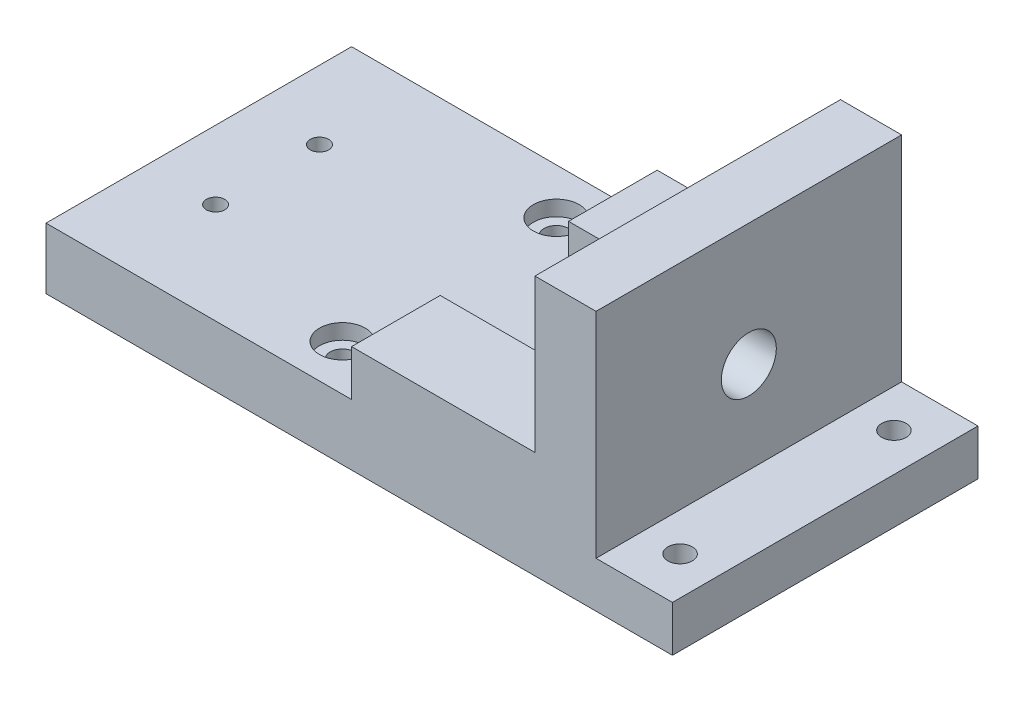
ISO-10303-21;
HEADER;
FILE_DESCRIPTION(('STEP AP214'),'2;1');
FILE_NAME('part.step','',(''),(''),'','','');
FILE_SCHEMA(('AUTOMOTIVE_DESIGN { 1 0 10303 214 1 1 1 1 }'));
ENDSEC;
DATA;
#1=APPLICATION_CONTEXT('core data for automotive mechanical design processes');
#2=APPLICATION_PROTOCOL_DEFINITION('international standard','automotive_design',2000,#1);
#3=PRODUCT_CONTEXT('',#1,'mechanical');
#4=PRODUCT('Part','Part','',(#3));
#5=PRODUCT_RELATED_PRODUCT_CATEGORY('part','',(#4));
#6=PRODUCT_DEFINITION_FORMATION('','',#4);
#7=PRODUCT_DEFINITION_CONTEXT('part definition',#1,'design');
#8=PRODUCT_DEFINITION('design','',#6,#7);
#9=PRODUCT_DEFINITION_SHAPE('','',#8);
#10=(LENGTH_UNIT() NAMED_UNIT(*) SI_UNIT(.MILLI.,.METRE.));
#11=(NAMED_UNIT(*) PLANE_ANGLE_UNIT() SI_UNIT($,.RADIAN.));
#12=(NAMED_UNIT(*) SI_UNIT($,.STERADIAN.) SOLID_ANGLE_UNIT());
#13=UNCERTAINTY_MEASURE_WITH_UNIT(LENGTH_MEASURE(1.E-05),#10,'distance_accuracy_value','');
#14=(GEOMETRIC_REPRESENTATION_CONTEXT(3) GLOBAL_UNCERTAINTY_ASSIGNED_CONTEXT((#13)) GLOBAL_UNIT_ASSIGNED_CONTEXT((#10,
#11,#12)) REPRESENTATION_CONTEXT('',''));
#15=CARTESIAN_POINT('',(0.,0.,0.));
#16=DIRECTION('',(0.,0.,1.));
#17=DIRECTION('',(1.,0.,0.));
#18=AXIS2_PLACEMENT_3D('',#15,#16,#17);
#19=CARTESIAN_POINT('',(-105.,20.,50.));
#20=DIRECTION('',(0.,-1.,0.));
#21=DIRECTION('',(1.,0.,0.));
#22=AXIS2_PLACEMENT_3D('',#19,#20,#21);
#23=PLANE('',#22);
#24=DIRECTION('',(-1.,0.,0.));
#25=VECTOR('',#24,1.);
#26=CARTESIAN_POINT('',(-105.,20.,-50.));
#27=LINE('',#26,#25);
#28=CARTESIAN_POINT('',(-105.,20.,-50.));
#29=VERTEX_POINT('',#28);
#30=CARTESIAN_POINT('',(-205.,20.,-50.));
#31=VERTEX_POINT('',#30);
#32=EDGE_CURVE('E198',#29,#31,#27,.T.);
#33=ORIENTED_EDGE('',*,*,#32,.T.);
#34=DIRECTION('',(0.,0.,-1.));
#35=VECTOR('',#34,1.);
#36=CARTESIAN_POINT('',(-205.,20.,50.));
#37=LINE('',#36,#35);
#38=CARTESIAN_POINT('',(-205.,20.,50.));
#39=VERTEX_POINT('',#38);
#40=EDGE_CURVE('E160',#39,#31,#37,.T.);
#41=ORIENTED_EDGE('',*,*,#40,.F.);
#42=DIRECTION('',(-1.,0.,0.));
#43=VECTOR('',#42,1.);
#44=CARTESIAN_POINT('',(-105.,20.,50.));
#45=LINE('',#44,#43);
#46=CARTESIAN_POINT('',(-105.,20.,50.));
#47=VERTEX_POINT('',#46);
#48=EDGE_CURVE('E139',#47,#39,#45,.T.);
#49=ORIENTED_EDGE('',*,*,#48,.F.);
#50=DIRECTION('',(0.,0.,-1.));
#51=VECTOR('',#50,1.);
#52=CARTESIAN_POINT('',(-105.,20.,50.));
#53=LINE('',#52,#51);
#54=CARTESIAN_POINT('',(-105.,20.,21.));
#55=VERTEX_POINT('',#54);
#56=EDGE_CURVE('E150',#47,#55,#53,.T.);
#57=ORIENTED_EDGE('',*,*,#56,.T.);
#58=DIRECTION('',(1.,0.,0.));
#59=VECTOR('',#58,1.);
#60=CARTESIAN_POINT('',(-105.,20.,21.));
#61=LINE('',#60,#59);
#62=CARTESIAN_POINT('',(-45.,20.,21.));
#63=VERTEX_POINT('',#62);
#64=EDGE_CURVE('E303',#55,#63,#61,.T.);
#65=ORIENTED_EDGE('',*,*,#64,.T.);
#66=DIRECTION('',(0.,0.,-1.));
#67=VECTOR('',#66,1.);
#68=CARTESIAN_POINT('',(-45.,20.,-21.));
#69=LINE('',#68,#67);
#70=CARTESIAN_POINT('',(-45.,20.,-21.));
#71=VERTEX_POINT('',#70);
#72=EDGE_CURVE('E314',#63,#71,#69,.T.);
#73=ORIENTED_EDGE('',*,*,#72,.T.);
#74=DIRECTION('',(-1.,0.,0.));
#75=VECTOR('',#74,1.);
#76=CARTESIAN_POINT('',(-105.,20.,-21.));
#77=LINE('',#76,#75);
#78=CARTESIAN_POINT('',(-105.,20.,-21.));
#79=VERTEX_POINT('',#78);
#80=EDGE_CURVE('E58',#71,#79,#77,.T.);
#81=ORIENTED_EDGE('',*,*,#80,.T.);
#82=EDGE_CURVE('E157',#79,#29,#53,.T.);
#83=ORIENTED_EDGE('',*,*,#82,.T.);
#84=EDGE_LOOP('',(#33,#41,#49,#57,#65,#73,#81,#83));
#85=FACE_BOUND('',#84,.T.);
#86=CARTESIAN_POINT('',(-182.5,20.,17.));
#87=DIRECTION('',(0.,-1.,0.));
#88=DIRECTION('',(1.,0.,0.));
#89=AXIS2_PLACEMENT_3D('',#86,#87,#88);
#90=CIRCLE('',#89,2.99999999999999);
#91=CARTESIAN_POINT('',(-179.5,20.,17.));
#92=VERTEX_POINT('',#91);
#93=EDGE_CURVE('E269',#92,#92,#90,.T.);
#94=ORIENTED_EDGE('',*,*,#93,.T.);
#95=EDGE_LOOP('',(#94));
#96=FACE_BOUND('',#95,.T.);
#97=CARTESIAN_POINT('',(-182.5,20.,-17.));
#98=DIRECTION('',(0.,1.,0.));
#99=DIRECTION('',(-1.,0.,0.));
#100=AXIS2_PLACEMENT_3D('',#97,#98,#99);
#101=CIRCLE('',#100,2.99999999999999);
#102=CARTESIAN_POINT('',(-185.5,20.,-17.));
#103=VERTEX_POINT('',#102);
#104=EDGE_CURVE('E281',#103,#103,#101,.T.);
#105=ORIENTED_EDGE('',*,*,#104,.F.);
#106=EDGE_LOOP('',(#105));
#107=FACE_BOUND('',#106,.T.);
#108=CARTESIAN_POINT('',(-123.,20.,-35.));
#109=DIRECTION('',(0.,1.,0.));
#110=DIRECTION('',(-1.,0.,0.));
#111=AXIS2_PLACEMENT_3D('',#108,#109,#110);
#112=CIRCLE('',#111,7.50000000000001);
#113=CARTESIAN_POINT('',(-130.5,20.,-35.));
#114=VERTEX_POINT('',#113);
#115=EDGE_CURVE('E256',#114,#114,#112,.T.);
#116=ORIENTED_EDGE('',*,*,#115,.F.);
#117=EDGE_LOOP('',(#116));
#118=FACE_BOUND('',#117,.T.);
#119=CARTESIAN_POINT('',(-123.,20.,35.));
#120=DIRECTION('',(0.,-1.,0.));
#121=DIRECTION('',(1.,0.,0.));
#122=AXIS2_PLACEMENT_3D('',#119,#120,#121);
#123=CIRCLE('',#122,7.50000000000001);
#124=CARTESIAN_POINT('',(-115.5,20.,35.));
#125=VERTEX_POINT('',#124);
#126=EDGE_CURVE('E263',#125,#125,#123,.T.);
#127=ORIENTED_EDGE('',*,*,#126,.T.);
#128=EDGE_LOOP('',(#127));
#129=FACE_BOUND('',#128,.T.);
#130=ADVANCED_FACE('F40',(#85,#96,#107,#118,#129),#23,.F.);
#131=CARTESIAN_POINT('',(-123.,0.,-35.));
#132=DIRECTION('',(0.,1.,0.));
#133=DIRECTION('',(-1.,0.,0.));
#134=AXIS2_PLACEMENT_3D('',#131,#132,#133);
#135=CYLINDRICAL_SURFACE('',#134,3.99999999999999);
#136=CARTESIAN_POINT('',(-123.,0.,-35.));
#137=DIRECTION('',(0.,1.,0.));
#138=DIRECTION('',(-1.,0.,0.));
#139=AXIS2_PLACEMENT_3D('',#136,#137,#138);
#140=CIRCLE('',#139,3.99999999999999);
#141=CARTESIAN_POINT('',(-127.,0.,-35.));
#142=VERTEX_POINT('',#141);
#143=EDGE_CURVE('E277',#142,#142,#140,.T.);
#144=ORIENTED_EDGE('',*,*,#143,.F.);
#145=EDGE_LOOP('',(#144));
#146=FACE_BOUND('',#145,.T.);
#147=CARTESIAN_POINT('',(-123.,15.,-35.));
#148=DIRECTION('',(0.,1.,0.));
#149=DIRECTION('',(-1.,0.,0.));
#150=AXIS2_PLACEMENT_3D('',#147,#148,#149);
#151=CIRCLE('',#150,3.99999999999999);
#152=CARTESIAN_POINT('',(-127.,15.,-35.));
#153=VERTEX_POINT('',#152);
#154=EDGE_CURVE('E244',#153,#153,#151,.F.);
#155=ORIENTED_EDGE('',*,*,#154,.F.);
#156=EDGE_LOOP('',(#155));
#157=FACE_BOUND('',#156,.T.);
#158=ADVANCED_FACE('F457',(#146,#157),#135,.F.);
#159=CARTESIAN_POINT('',(-205.,0.,50.));
#160=DIRECTION('',(0.,1.,0.));
#161=DIRECTION('',(0.,0.,1.));
#162=AXIS2_PLACEMENT_3D('',#159,#160,#161);
#163=PLANE('',#162);
#164=ORIENTED_EDGE('',*,*,#143,.T.);
#165=EDGE_LOOP('',(#164));
#166=FACE_BOUND('',#165,.T.);
#167=CARTESIAN_POINT('',(-182.5,0.,-17.));
#168=DIRECTION('',(0.,1.,0.));
#169=DIRECTION('',(-1.,0.,0.));
#170=AXIS2_PLACEMENT_3D('',#167,#168,#169);
#171=CIRCLE('',#170,2.99999999999999);
#172=CARTESIAN_POINT('',(-185.5,0.,-17.));
#173=VERTEX_POINT('',#172);
#174=EDGE_CURVE('E285',#173,#173,#171,.T.);
#175=ORIENTED_EDGE('',*,*,#174,.T.);
#176=EDGE_LOOP('',(#175));
#177=FACE_BOUND('',#176,.T.);
#178=CARTESIAN_POINT('',(-12.5,0.,-35.));
#179=DIRECTION('',(0.,1.,0.));
#180=DIRECTION('',(-1.,0.,0.));
#181=AXIS2_PLACEMENT_3D('',#178,#179,#180);
#182=CIRCLE('',#181,4.00000000000001);
#183=CARTESIAN_POINT('',(-16.5,0.,-35.));
#184=VERTEX_POINT('',#183);
#185=EDGE_CURVE('E240',#184,#184,#182,.T.);
#186=ORIENTED_EDGE('',*,*,#185,.T.);
#187=EDGE_LOOP('',(#186));
#188=FACE_BOUND('',#187,.T.);
#189=DIRECTION('',(1.,0.,0.));
#190=VECTOR('',#189,1.);
#191=CARTESIAN_POINT('',(-205.,0.,-50.));
#192=LINE('',#191,#190);
#193=CARTESIAN_POINT('',(-205.,0.,-50.));
#194=VERTEX_POINT('',#193);
#195=CARTESIAN_POINT('',(0.,0.,-50.));
#196=VERTEX_POINT('',#195);
#197=EDGE_CURVE('E169',#194,#196,#192,.T.);
#198=ORIENTED_EDGE('',*,*,#197,.T.);
#199=DIRECTION('',(0.,0.,-1.));
#200=VECTOR('',#199,1.);
#201=CARTESIAN_POINT('',(0.,0.,50.));
#202=LINE('',#201,#200);
#203=CARTESIAN_POINT('',(0.,0.,50.));
#204=VERTEX_POINT('',#203);
#205=EDGE_CURVE('E11',#204,#196,#202,.T.);
#206=ORIENTED_EDGE('',*,*,#205,.F.);
#207=DIRECTION('',(1.,0.,0.));
#208=VECTOR('',#207,1.);
#209=CARTESIAN_POINT('',(-205.,0.,50.));
#210=LINE('',#209,#208);
#211=CARTESIAN_POINT('',(-205.,0.,50.));
#212=VERTEX_POINT('',#211);
#213=EDGE_CURVE('E203',#212,#204,#210,.T.);
#214=ORIENTED_EDGE('',*,*,#213,.F.);
#215=DIRECTION('',(0.,0.,-1.));
#216=VECTOR('',#215,1.);
#217=CARTESIAN_POINT('',(-205.,0.,50.));
#218=LINE('',#217,#216);
#219=EDGE_CURVE('E165',#212,#194,#218,.T.);
#220=ORIENTED_EDGE('',*,*,#219,.T.);
#221=EDGE_LOOP('',(#198,#206,#214,#220));
#222=FACE_BOUND('',#221,.T.);
#223=CARTESIAN_POINT('',(-182.5,0.,17.));
#224=DIRECTION('',(0.,-1.,0.));
#225=DIRECTION('',(1.,0.,0.));
#226=AXIS2_PLACEMENT_3D('',#223,#224,#225);
#227=CIRCLE('',#226,2.99999999999999);
#228=CARTESIAN_POINT('',(-179.5,0.,17.));
#229=VERTEX_POINT('',#228);
#230=EDGE_CURVE('E254',#229,#229,#227,.T.);
#231=ORIENTED_EDGE('',*,*,#230,.F.);
#232=EDGE_LOOP('',(#231));
#233=FACE_BOUND('',#232,.T.);
#234=CARTESIAN_POINT('',(-123.,0.,35.));
#235=DIRECTION('',(0.,-1.,0.));
#236=DIRECTION('',(1.,0.,0.));
#237=AXIS2_PLACEMENT_3D('',#234,#235,#236);
#238=CIRCLE('',#237,3.99999999999999);
#239=CARTESIAN_POINT('',(-119.,0.,35.));
#240=VERTEX_POINT('',#239);
#241=EDGE_CURVE('E273',#240,#240,#238,.T.);
#242=ORIENTED_EDGE('',*,*,#241,.F.);
#243=EDGE_LOOP('',(#242));
#244=FACE_BOUND('',#243,.T.);
#245=CARTESIAN_POINT('',(-12.5,0.,35.));
#246=DIRECTION('',(0.,-1.,0.));
#247=DIRECTION('',(1.,0.,0.));
#248=AXIS2_PLACEMENT_3D('',#245,#246,#247);
#249=CIRCLE('',#248,4.00000000000001);
#250=CARTESIAN_POINT('',(-8.50000000000001,0.,35.));
#251=VERTEX_POINT('',#250);
#252=EDGE_CURVE('E289',#251,#251,#249,.T.);
#253=ORIENTED_EDGE('',*,*,#252,.F.);
#254=EDGE_LOOP('',(#253));
#255=FACE_BOUND('',#254,.T.);
#256=ADVANCED_FACE('F42',(#166,#177,#188,#222,#233,#244,#255),#163,.F.);
#257=CARTESIAN_POINT('',(0.,15.,50.));
#258=DIRECTION('',(0.,-1.,0.));
#259=DIRECTION('',(1.,0.,0.));
#260=AXIS2_PLACEMENT_3D('',#257,#258,#259);
#261=PLANE('',#260);
#262=CARTESIAN_POINT('',(-12.5,15.,35.));
#263=DIRECTION('',(0.,-1.,0.));
#264=DIRECTION('',(1.,0.,0.));
#265=AXIS2_PLACEMENT_3D('',#262,#263,#264);
#266=CIRCLE('',#265,4.00000000000001);
#267=CARTESIAN_POINT('',(-8.50000000000001,15.,35.));
#268=VERTEX_POINT('',#267);
#269=EDGE_CURVE('E239',#268,#268,#266,.F.);
#270=ORIENTED_EDGE('',*,*,#269,.F.);
#271=EDGE_LOOP('',(#270));
#272=FACE_BOUND('',#271,.T.);
#273=CARTESIAN_POINT('',(-12.5,15.,-35.));
#274=DIRECTION('',(0.,-1.,0.));
#275=DIRECTION('',(1.,0.,0.));
#276=AXIS2_PLACEMENT_3D('',#273,#274,#275);
#277=CIRCLE('',#276,4.00000000000001);
#278=CARTESIAN_POINT('',(-8.50000000000001,15.,-35.));
#279=VERTEX_POINT('',#278);
#280=EDGE_CURVE('E235',#279,#279,#277,.T.);
#281=ORIENTED_EDGE('',*,*,#280,.T.);
#282=EDGE_LOOP('',(#281));
#283=FACE_BOUND('',#282,.T.);
#284=DIRECTION('',(-1.,0.,0.));
#285=VECTOR('',#284,1.);
#286=CARTESIAN_POINT('',(0.,15.,-50.));
#287=LINE('',#286,#285);
#288=CARTESIAN_POINT('',(0.,15.,-50.));
#289=VERTEX_POINT('',#288);
#290=CARTESIAN_POINT('',(-25.,15.,-50.));
#291=VERTEX_POINT('',#290);
#292=EDGE_CURVE('E177',#289,#291,#287,.T.);
#293=ORIENTED_EDGE('',*,*,#292,.T.);
#294=DIRECTION('',(0.,0.,-1.));
#295=VECTOR('',#294,1.);
#296=CARTESIAN_POINT('',(-25.,15.,50.));
#297=LINE('',#296,#295);
#298=CARTESIAN_POINT('',(-25.,15.,50.));
#299=VERTEX_POINT('',#298);
#300=EDGE_CURVE('E224',#299,#291,#297,.T.);
#301=ORIENTED_EDGE('',*,*,#300,.F.);
#302=DIRECTION('',(-1.,0.,0.));
#303=VECTOR('',#302,1.);
#304=CARTESIAN_POINT('',(0.,15.,50.));
#305=LINE('',#304,#303);
#306=CARTESIAN_POINT('',(0.,15.,50.));
#307=VERTEX_POINT('',#306);
#308=EDGE_CURVE('E335',#307,#299,#305,.T.);
#309=ORIENTED_EDGE('',*,*,#308,.F.);
#310=DIRECTION('',(0.,0.,-1.));
#311=VECTOR('',#310,1.);
#312=CARTESIAN_POINT('',(0.,15.,50.));
#313=LINE('',#312,#311);
#314=EDGE_CURVE('E50',#307,#289,#313,.T.);
#315=ORIENTED_EDGE('',*,*,#314,.T.);
#316=EDGE_LOOP('',(#293,#301,#309,#315));
#317=FACE_BOUND('',#316,.T.);
#318=ADVANCED_FACE('F478',(#272,#283,#317),#261,.F.);
#319=CARTESIAN_POINT('',(-45.,35.,50.));
#320=DIRECTION('',(0.,-1.,0.));
#321=DIRECTION('',(1.,0.,0.));
#322=AXIS2_PLACEMENT_3D('',#319,#320,#321);
#323=PLANE('',#322);
#324=DIRECTION('',(0.,0.,-1.));
#325=VECTOR('',#324,1.);
#326=CARTESIAN_POINT('',(-45.,35.,50.));
#327=LINE('',#326,#325);
#328=CARTESIAN_POINT('',(-45.,35.,50.));
#329=VERTEX_POINT('',#328);
#330=CARTESIAN_POINT('',(-45.,35.,21.));
#331=VERTEX_POINT('',#330);
#332=EDGE_CURVE('E212',#329,#331,#327,.T.);
#333=ORIENTED_EDGE('',*,*,#332,.T.);
#334=DIRECTION('',(1.,0.,0.));
#335=VECTOR('',#334,1.);
#336=CARTESIAN_POINT('',(-105.,35.,21.));
#337=LINE('',#336,#335);
#338=CARTESIAN_POINT('',(-105.,35.,21.));
#339=VERTEX_POINT('',#338);
#340=EDGE_CURVE('E243',#339,#331,#337,.T.);
#341=ORIENTED_EDGE('',*,*,#340,.F.);
#342=DIRECTION('',(0.,0.,-1.));
#343=VECTOR('',#342,1.);
#344=CARTESIAN_POINT('',(-105.,35.,50.));
#345=LINE('',#344,#343);
#346=CARTESIAN_POINT('',(-105.,35.,50.));
#347=VERTEX_POINT('',#346);
#348=EDGE_CURVE('E208',#347,#339,#345,.T.);
#349=ORIENTED_EDGE('',*,*,#348,.F.);
#350=DIRECTION('',(-1.,0.,0.));
#351=VECTOR('',#350,1.);
#352=CARTESIAN_POINT('',(-45.,35.,50.));
#353=LINE('',#352,#351);
#354=EDGE_CURVE('E142',#329,#347,#353,.T.);
#355=ORIENTED_EDGE('',*,*,#354,.F.);
#356=EDGE_LOOP('',(#333,#341,#349,#355));
#357=FACE_BOUND('',#356,.T.);
#358=ADVANCED_FACE('F398',(#357),#323,.F.);
#359=CARTESIAN_POINT('',(-105.,35.,50.));
#360=DIRECTION('',(1.,0.,0.));
#361=DIRECTION('',(0.,0.,-1.));
#362=AXIS2_PLACEMENT_3D('',#359,#360,#361);
#363=PLANE('',#362);
#364=ORIENTED_EDGE('',*,*,#348,.T.);
#365=DIRECTION('',(0.,1.,0.));
#366=VECTOR('',#365,1.);
#367=CARTESIAN_POINT('',(-105.,-53.2393336944022,21.));
#368=LINE('',#367,#366);
#369=EDGE_CURVE('E153',#55,#339,#368,.T.);
#370=ORIENTED_EDGE('',*,*,#369,.F.);
#371=ORIENTED_EDGE('',*,*,#56,.F.);
#372=DIRECTION('',(0.,-1.,0.));
#373=VECTOR('',#372,1.);
#374=CARTESIAN_POINT('',(-105.,35.,50.));
#375=LINE('',#374,#373);
#376=EDGE_CURVE('E135',#347,#47,#375,.T.);
#377=ORIENTED_EDGE('',*,*,#376,.F.);
#378=EDGE_LOOP('',(#364,#370,#371,#377));
#379=FACE_BOUND('',#378,.T.);
#380=ADVANCED_FACE('F151',(#379),#363,.F.);
#381=CARTESIAN_POINT('',(0.,0.,50.));
#382=DIRECTION('',(-1.,0.,0.));
#383=DIRECTION('',(0.,0.,1.));
#384=AXIS2_PLACEMENT_3D('',#381,#382,#383);
#385=PLANE('',#384);
#386=DIRECTION('',(0.,1.,0.));
#387=VECTOR('',#386,1.);
#388=CARTESIAN_POINT('',(0.,0.,-50.));
#389=LINE('',#388,#387);
#390=EDGE_CURVE('E173',#196,#289,#389,.T.);
#391=ORIENTED_EDGE('',*,*,#390,.T.);
#392=ORIENTED_EDGE('',*,*,#314,.F.);
#393=DIRECTION('',(0.,1.,0.));
#394=VECTOR('',#393,1.);
#395=CARTESIAN_POINT('',(0.,0.,50.));
#396=LINE('',#395,#394);
#397=EDGE_CURVE('E113',#204,#307,#396,.T.);
#398=ORIENTED_EDGE('',*,*,#397,.F.);
#399=ORIENTED_EDGE('',*,*,#205,.T.);
#400=EDGE_LOOP('',(#391,#392,#398,#399));
#401=FACE_BOUND('',#400,.T.);
#402=ADVANCED_FACE('F476',(#401),#385,.F.);
#403=CARTESIAN_POINT('',(-25.,15.,50.));
#404=DIRECTION('',(-1.,0.,0.));
#405=DIRECTION('',(0.,0.,1.));
#406=AXIS2_PLACEMENT_3D('',#403,#404,#405);
#407=PLANE('',#406);
#408=CARTESIAN_POINT('',(-25.,45.,0.));
#409=DIRECTION('',(-1.,0.,0.));
#410=DIRECTION('',(0.,0.,1.));
#411=AXIS2_PLACEMENT_3D('',#408,#409,#410);
#412=CIRCLE('',#411,9.);
#413=CARTESIAN_POINT('',(-25.,45.,9.));
#414=VERTEX_POINT('',#413);
#415=EDGE_CURVE('E174',#414,#414,#412,.T.);
#416=ORIENTED_EDGE('',*,*,#415,.T.);
#417=EDGE_LOOP('',(#416));
#418=FACE_BOUND('',#417,.T.);
#419=DIRECTION('',(0.,1.,0.));
#420=VECTOR('',#419,1.);
#421=CARTESIAN_POINT('',(-25.,15.,-50.));
#422=LINE('',#421,#420);
#423=CARTESIAN_POINT('',(-25.,85.,-50.));
#424=VERTEX_POINT('',#423);
#425=EDGE_CURVE('E180',#291,#424,#422,.T.);
#426=ORIENTED_EDGE('',*,*,#425,.T.);
#427=DIRECTION('',(0.,0.,-1.));
#428=VECTOR('',#427,1.);
#429=CARTESIAN_POINT('',(-25.,85.,50.));
#430=LINE('',#429,#428);
#431=CARTESIAN_POINT('',(-25.,85.,50.));
#432=VERTEX_POINT('',#431);
#433=EDGE_CURVE('E220',#432,#424,#430,.T.);
#434=ORIENTED_EDGE('',*,*,#433,.F.);
#435=DIRECTION('',(0.,1.,0.));
#436=VECTOR('',#435,1.);
#437=CARTESIAN_POINT('',(-25.,15.,50.));
#438=LINE('',#437,#436);
#439=EDGE_CURVE('E338',#299,#432,#438,.T.);
#440=ORIENTED_EDGE('',*,*,#439,.F.);
#441=ORIENTED_EDGE('',*,*,#300,.T.);
#442=EDGE_LOOP('',(#426,#434,#440,#441));
#443=FACE_BOUND('',#442,.T.);
#444=ADVANCED_FACE('F472',(#418,#443),#407,.F.);
#445=CARTESIAN_POINT('',(-25.,85.,50.));
#446=DIRECTION('',(0.,-1.,0.));
#447=DIRECTION('',(0.,0.,-1.));
#448=AXIS2_PLACEMENT_3D('',#445,#446,#447);
#449=PLANE('',#448);
#450=DIRECTION('',(-1.,0.,0.));
#451=VECTOR('',#450,1.);
#452=CARTESIAN_POINT('',(-25.,85.,-50.));
#453=LINE('',#452,#451);
#454=CARTESIAN_POINT('',(-45.,85.,-50.));
#455=VERTEX_POINT('',#454);
#456=EDGE_CURVE('E183',#424,#455,#453,.T.);
#457=ORIENTED_EDGE('',*,*,#456,.T.);
#458=DIRECTION('',(0.,0.,-1.));
#459=VECTOR('',#458,1.);
#460=CARTESIAN_POINT('',(-45.,85.,50.));
#461=LINE('',#460,#459);
#462=CARTESIAN_POINT('',(-45.,85.,50.));
#463=VERTEX_POINT('',#462);
#464=EDGE_CURVE('E216',#463,#455,#461,.T.);
#465=ORIENTED_EDGE('',*,*,#464,.F.);
#466=DIRECTION('',(-1.,0.,0.));
#467=VECTOR('',#466,1.);
#468=CARTESIAN_POINT('',(-25.,85.,50.));
#469=LINE('',#468,#467);
#470=EDGE_CURVE('E341',#432,#463,#469,.T.);
#471=ORIENTED_EDGE('',*,*,#470,.F.);
#472=ORIENTED_EDGE('',*,*,#433,.T.);
#473=EDGE_LOOP('',(#457,#465,#471,#472));
#474=FACE_BOUND('',#473,.T.);
#475=ADVANCED_FACE('F468',(#474),#449,.F.);
#476=CARTESIAN_POINT('',(-45.,85.,50.));
#477=DIRECTION('',(1.,0.,0.));
#478=DIRECTION('',(0.,1.,0.));
#479=AXIS2_PLACEMENT_3D('',#476,#477,#478);
#480=PLANE('',#479);
#481=CARTESIAN_POINT('',(-45.,45.,0.));
#482=DIRECTION('',(1.,0.,0.));
#483=DIRECTION('',(0.,1.,0.));
#484=AXIS2_PLACEMENT_3D('',#481,#482,#483);
#485=CIRCLE('',#484,9.);
#486=CARTESIAN_POINT('',(-45.,54.,0.));
#487=VERTEX_POINT('',#486);
#488=EDGE_CURVE('E231',#487,#487,#485,.T.);
#489=ORIENTED_EDGE('',*,*,#488,.T.);
#490=EDGE_LOOP('',(#489));
#491=FACE_BOUND('',#490,.T.);
#492=DIRECTION('',(0.,-1.,0.));
#493=VECTOR('',#492,1.);
#494=CARTESIAN_POINT('',(-45.,85.,-50.));
#495=LINE('',#494,#493);
#496=CARTESIAN_POINT('',(-45.,35.,-50.));
#497=VERTEX_POINT('',#496);
#498=EDGE_CURVE('E186',#455,#497,#495,.T.);
#499=ORIENTED_EDGE('',*,*,#498,.T.);
#500=CARTESIAN_POINT('',(-45.,35.,-21.));
#501=VERTEX_POINT('',#500);
#502=EDGE_CURVE('E211',#501,#497,#327,.T.);
#503=ORIENTED_EDGE('',*,*,#502,.F.);
#504=DIRECTION('',(0.,1.,0.));
#505=VECTOR('',#504,1.);
#506=CARTESIAN_POINT('',(-45.,-53.2393336944022,-21.));
#507=LINE('',#506,#505);
#508=EDGE_CURVE('E313',#71,#501,#507,.T.);
#509=ORIENTED_EDGE('',*,*,#508,.F.);
#510=ORIENTED_EDGE('',*,*,#72,.F.);
#511=DIRECTION('',(0.,1.,0.));
#512=VECTOR('',#511,1.);
#513=CARTESIAN_POINT('',(-45.,-53.2393336944022,21.));
#514=LINE('',#513,#512);
#515=EDGE_CURVE('E309',#63,#331,#514,.T.);
#516=ORIENTED_EDGE('',*,*,#515,.T.);
#517=ORIENTED_EDGE('',*,*,#332,.F.);
#518=DIRECTION('',(0.,-1.,0.));
#519=VECTOR('',#518,1.);
#520=CARTESIAN_POINT('',(-45.,85.,50.));
#521=LINE('',#520,#519);
#522=EDGE_CURVE('E344',#463,#329,#521,.T.);
#523=ORIENTED_EDGE('',*,*,#522,.F.);
#524=ORIENTED_EDGE('',*,*,#464,.T.);
#525=EDGE_LOOP('',(#499,#503,#509,#510,#516,#517,#523,#524));
#526=FACE_BOUND('',#525,.T.);
#527=ADVANCED_FACE('F392',(#491,#526),#480,.F.);
#528=CARTESIAN_POINT('',(-105.,35.,-21.));
#529=VERTEX_POINT('',#528);
#530=CARTESIAN_POINT('',(-105.,35.,-50.));
#531=VERTEX_POINT('',#530);
#532=EDGE_CURVE('E156',#529,#531,#345,.T.);
#533=ORIENTED_EDGE('',*,*,#532,.F.);
#534=DIRECTION('',(-1.,0.,0.));
#535=VECTOR('',#534,1.);
#536=CARTESIAN_POINT('',(-105.,35.,-21.));
#537=LINE('',#536,#535);
#538=EDGE_CURVE('E299',#501,#529,#537,.T.);
#539=ORIENTED_EDGE('',*,*,#538,.F.);
#540=ORIENTED_EDGE('',*,*,#502,.T.);
#541=DIRECTION('',(-1.,0.,0.));
#542=VECTOR('',#541,1.);
#543=CARTESIAN_POINT('',(-45.,35.,-50.));
#544=LINE('',#543,#542);
#545=EDGE_CURVE('E190',#497,#531,#544,.T.);
#546=ORIENTED_EDGE('',*,*,#545,.T.);
#547=EDGE_LOOP('',(#533,#539,#540,#546));
#548=FACE_BOUND('',#547,.T.);
#549=ADVANCED_FACE('F417',(#548),#323,.F.);
#550=ORIENTED_EDGE('',*,*,#82,.F.);
#551=DIRECTION('',(0.,1.,0.));
#552=VECTOR('',#551,1.);
#553=CARTESIAN_POINT('',(-105.,-53.2393336944022,-21.));
#554=LINE('',#553,#552);
#555=EDGE_CURVE('E312',#79,#529,#554,.T.);
#556=ORIENTED_EDGE('',*,*,#555,.T.);
#557=ORIENTED_EDGE('',*,*,#532,.T.);
#558=DIRECTION('',(0.,-1.,0.));
#559=VECTOR('',#558,1.);
#560=CARTESIAN_POINT('',(-105.,35.,-50.));
#561=LINE('',#560,#559);
#562=EDGE_CURVE('E194',#531,#29,#561,.T.);
#563=ORIENTED_EDGE('',*,*,#562,.T.);
#564=EDGE_LOOP('',(#550,#556,#557,#563));
#565=FACE_BOUND('',#564,.T.);
#566=ADVANCED_FACE('F436',(#565),#363,.F.);
#567=CARTESIAN_POINT('',(-205.,20.,50.));
#568=DIRECTION('',(1.,0.,0.));
#569=DIRECTION('',(0.,0.,-1.));
#570=AXIS2_PLACEMENT_3D('',#567,#568,#569);
#571=PLANE('',#570);
#572=DIRECTION('',(0.,-1.,0.));
#573=VECTOR('',#572,1.);
#574=CARTESIAN_POINT('',(-205.,20.,-50.));
#575=LINE('',#574,#573);
#576=EDGE_CURVE('E105',#31,#194,#575,.T.);
#577=ORIENTED_EDGE('',*,*,#576,.T.);
#578=ORIENTED_EDGE('',*,*,#219,.F.);
#579=DIRECTION('',(0.,-1.,0.));
#580=VECTOR('',#579,1.);
#581=CARTESIAN_POINT('',(-205.,20.,50.));
#582=LINE('',#581,#580);
#583=EDGE_CURVE('E67',#39,#212,#582,.T.);
#584=ORIENTED_EDGE('',*,*,#583,.F.);
#585=ORIENTED_EDGE('',*,*,#40,.T.);
#586=EDGE_LOOP('',(#577,#578,#584,#585));
#587=FACE_BOUND('',#586,.T.);
#588=ADVANCED_FACE('F445',(#587),#571,.F.);
#589=CARTESIAN_POINT('',(0.,0.,50.));
#590=DIRECTION('',(0.,0.,1.));
#591=DIRECTION('',(1.,0.,0.));
#592=AXIS2_PLACEMENT_3D('',#589,#590,#591);
#593=PLANE('',#592);
#594=ORIENTED_EDGE('',*,*,#213,.T.);
#595=ORIENTED_EDGE('',*,*,#397,.T.);
#596=ORIENTED_EDGE('',*,*,#308,.T.);
#597=ORIENTED_EDGE('',*,*,#439,.T.);
#598=ORIENTED_EDGE('',*,*,#470,.T.);
#599=ORIENTED_EDGE('',*,*,#522,.T.);
#600=ORIENTED_EDGE('',*,*,#354,.T.);
#601=ORIENTED_EDGE('',*,*,#376,.T.);
#602=ORIENTED_EDGE('',*,*,#48,.T.);
#603=ORIENTED_EDGE('',*,*,#583,.T.);
#604=EDGE_LOOP('',(#594,#595,#596,#597,#598,#599,#600,#601,#602,#603));
#605=FACE_BOUND('',#604,.T.);
#606=ADVANCED_FACE('F137',(#605),#593,.T.);
#607=CARTESIAN_POINT('',(0.,0.,-50.));
#608=DIRECTION('',(0.,0.,1.));
#609=DIRECTION('',(1.,0.,0.));
#610=AXIS2_PLACEMENT_3D('',#607,#608,#609);
#611=PLANE('',#610);
#612=ORIENTED_EDGE('',*,*,#197,.F.);
#613=ORIENTED_EDGE('',*,*,#576,.F.);
#614=ORIENTED_EDGE('',*,*,#32,.F.);
#615=ORIENTED_EDGE('',*,*,#562,.F.);
#616=ORIENTED_EDGE('',*,*,#545,.F.);
#617=ORIENTED_EDGE('',*,*,#498,.F.);
#618=ORIENTED_EDGE('',*,*,#456,.F.);
#619=ORIENTED_EDGE('',*,*,#425,.F.);
#620=ORIENTED_EDGE('',*,*,#292,.F.);
#621=ORIENTED_EDGE('',*,*,#390,.F.);
#622=EDGE_LOOP('',(#612,#613,#614,#615,#616,#617,#618,#619,#620,#621));
#623=FACE_BOUND('',#622,.T.);
#624=ADVANCED_FACE('F439',(#623),#611,.F.);
#625=CARTESIAN_POINT('',(-205.,45.,0.));
#626=DIRECTION('',(1.,0.,0.));
#627=DIRECTION('',(0.,0.,-1.));
#628=AXIS2_PLACEMENT_3D('',#625,#626,#627);
#629=CYLINDRICAL_SURFACE('',#628,9.);
#630=ORIENTED_EDGE('',*,*,#488,.F.);
#631=EDGE_LOOP('',(#630));
#632=FACE_BOUND('',#631,.T.);
#633=ORIENTED_EDGE('',*,*,#415,.F.);
#634=EDGE_LOOP('',(#633));
#635=FACE_BOUND('',#634,.T.);
#636=ADVANCED_FACE('F613',(#632,#635),#629,.F.);
#637=CARTESIAN_POINT('',(-105.,-53.2393336944022,21.));
#638=DIRECTION('',(0.,0.,1.));
#639=DIRECTION('',(1.,0.,0.));
#640=AXIS2_PLACEMENT_3D('',#637,#638,#639);
#641=PLANE('',#640);
#642=ORIENTED_EDGE('',*,*,#369,.T.);
#643=ORIENTED_EDGE('',*,*,#340,.T.);
#644=ORIENTED_EDGE('',*,*,#515,.F.);
#645=ORIENTED_EDGE('',*,*,#64,.F.);
#646=EDGE_LOOP('',(#642,#643,#644,#645));
#647=FACE_BOUND('',#646,.T.);
#648=ADVANCED_FACE('F606',(#647),#641,.F.);
#649=CARTESIAN_POINT('',(-105.,-53.2393336944022,-21.));
#650=DIRECTION('',(0.,0.,-1.));
#651=DIRECTION('',(-1.,0.,0.));
#652=AXIS2_PLACEMENT_3D('',#649,#650,#651);
#653=PLANE('',#652);
#654=ORIENTED_EDGE('',*,*,#508,.T.);
#655=ORIENTED_EDGE('',*,*,#538,.T.);
#656=ORIENTED_EDGE('',*,*,#555,.F.);
#657=ORIENTED_EDGE('',*,*,#80,.F.);
#658=EDGE_LOOP('',(#654,#655,#656,#657));
#659=FACE_BOUND('',#658,.T.);
#660=ADVANCED_FACE('F413',(#659),#653,.F.);
#661=CARTESIAN_POINT('',(-182.5,0.,17.));
#662=DIRECTION('',(0.,1.,0.));
#663=DIRECTION('',(-1.,0.,0.));
#664=AXIS2_PLACEMENT_3D('',#661,#662,#663);
#665=CYLINDRICAL_SURFACE('',#664,2.99999999999999);
#666=ORIENTED_EDGE('',*,*,#230,.T.);
#667=EDGE_LOOP('',(#666));
#668=FACE_BOUND('',#667,.T.);
#669=ORIENTED_EDGE('',*,*,#93,.F.);
#670=EDGE_LOOP('',(#669));
#671=FACE_BOUND('',#670,.T.);
#672=ADVANCED_FACE('F591',(#668,#671),#665,.F.);
#673=CARTESIAN_POINT('',(-123.,0.,35.));
#674=DIRECTION('',(0.,1.,0.));
#675=DIRECTION('',(-1.,0.,0.));
#676=AXIS2_PLACEMENT_3D('',#673,#674,#675);
#677=CYLINDRICAL_SURFACE('',#676,3.99999999999999);
#678=CARTESIAN_POINT('',(-123.,15.,35.));
#679=DIRECTION('',(0.,-1.,0.));
#680=DIRECTION('',(1.,0.,0.));
#681=AXIS2_PLACEMENT_3D('',#678,#679,#680);
#682=CIRCLE('',#681,3.99999999999999);
#683=CARTESIAN_POINT('',(-119.,15.,35.));
#684=VERTEX_POINT('',#683);
#685=EDGE_CURVE('E44',#684,#684,#682,.T.);
#686=ORIENTED_EDGE('',*,*,#685,.F.);
#687=EDGE_LOOP('',(#686));
#688=FACE_BOUND('',#687,.T.);
#689=ORIENTED_EDGE('',*,*,#241,.T.);
#690=EDGE_LOOP('',(#689));
#691=FACE_BOUND('',#690,.T.);
#692=ADVANCED_FACE('F583',(#688,#691),#677,.F.);
#693=CARTESIAN_POINT('',(-182.5,0.,-17.));
#694=DIRECTION('',(0.,1.,0.));
#695=DIRECTION('',(-1.,0.,0.));
#696=AXIS2_PLACEMENT_3D('',#693,#694,#695);
#697=CYLINDRICAL_SURFACE('',#696,2.99999999999999);
#698=ORIENTED_EDGE('',*,*,#174,.F.);
#699=EDGE_LOOP('',(#698));
#700=FACE_BOUND('',#699,.T.);
#701=ORIENTED_EDGE('',*,*,#104,.T.);
#702=EDGE_LOOP('',(#701));
#703=FACE_BOUND('',#702,.T.);
#704=ADVANCED_FACE('F575',(#700,#703),#697,.F.);
#705=CARTESIAN_POINT('',(-12.5,0.,-35.));
#706=DIRECTION('',(0.,1.,0.));
#707=DIRECTION('',(-1.,0.,0.));
#708=AXIS2_PLACEMENT_3D('',#705,#706,#707);
#709=CYLINDRICAL_SURFACE('',#708,4.00000000000001);
#710=ORIENTED_EDGE('',*,*,#185,.F.);
#711=EDGE_LOOP('',(#710));
#712=FACE_BOUND('',#711,.T.);
#713=ORIENTED_EDGE('',*,*,#280,.F.);
#714=EDGE_LOOP('',(#713));
#715=FACE_BOUND('',#714,.T.);
#716=ADVANCED_FACE('F568',(#712,#715),#709,.F.);
#717=CARTESIAN_POINT('',(-12.5,0.,35.));
#718=DIRECTION('',(0.,1.,0.));
#719=DIRECTION('',(-1.,0.,0.));
#720=AXIS2_PLACEMENT_3D('',#717,#718,#719);
#721=CYLINDRICAL_SURFACE('',#720,4.00000000000001);
#722=ORIENTED_EDGE('',*,*,#252,.T.);
#723=EDGE_LOOP('',(#722));
#724=FACE_BOUND('',#723,.T.);
#725=ORIENTED_EDGE('',*,*,#269,.T.);
#726=EDGE_LOOP('',(#725));
#727=FACE_BOUND('',#726,.T.);
#728=ADVANCED_FACE('F532',(#724,#727),#721,.F.);
#729=CARTESIAN_POINT('',(-123.,15.,-35.));
#730=DIRECTION('',(0.,1.,0.));
#731=DIRECTION('',(-1.,0.,0.));
#732=AXIS2_PLACEMENT_3D('',#729,#730,#731);
#733=PLANE('',#732);
#734=CARTESIAN_POINT('',(-123.,15.,-35.));
#735=DIRECTION('',(0.,1.,0.));
#736=DIRECTION('',(-1.,0.,0.));
#737=AXIS2_PLACEMENT_3D('',#734,#735,#736);
#738=CIRCLE('',#737,7.50000000000001);
#739=CARTESIAN_POINT('',(-130.5,15.,-35.));
#740=VERTEX_POINT('',#739);
#741=EDGE_CURVE('E247',#740,#740,#738,.T.);
#742=ORIENTED_EDGE('',*,*,#741,.T.);
#743=EDGE_LOOP('',(#742));
#744=FACE_BOUND('',#743,.T.);
#745=ORIENTED_EDGE('',*,*,#154,.T.);
#746=EDGE_LOOP('',(#745));
#747=FACE_BOUND('',#746,.T.);
#748=ADVANCED_FACE('F525',(#744,#747),#733,.T.);
#749=CARTESIAN_POINT('',(-123.,15.,-35.));
#750=DIRECTION('',(0.,1.,0.));
#751=DIRECTION('',(-1.,0.,0.));
#752=AXIS2_PLACEMENT_3D('',#749,#750,#751);
#753=CYLINDRICAL_SURFACE('',#752,7.50000000000001);
#754=ORIENTED_EDGE('',*,*,#741,.F.);
#755=EDGE_LOOP('',(#754));
#756=FACE_BOUND('',#755,.T.);
#757=ORIENTED_EDGE('',*,*,#115,.T.);
#758=EDGE_LOOP('',(#757));
#759=FACE_BOUND('',#758,.T.);
#760=ADVANCED_FACE('F531',(#756,#759),#753,.F.);
#761=CARTESIAN_POINT('',(-123.,15.,35.));
#762=DIRECTION('',(0.,1.,0.));
#763=DIRECTION('',(-1.,0.,0.));
#764=AXIS2_PLACEMENT_3D('',#761,#762,#763);
#765=CYLINDRICAL_SURFACE('',#764,7.50000000000001);
#766=CARTESIAN_POINT('',(-123.,15.,35.));
#767=DIRECTION('',(0.,-1.,0.));
#768=DIRECTION('',(1.,0.,0.));
#769=AXIS2_PLACEMENT_3D('',#766,#767,#768);
#770=CIRCLE('',#769,7.50000000000001);
#771=CARTESIAN_POINT('',(-115.5,15.,35.));
#772=VERTEX_POINT('',#771);
#773=EDGE_CURVE('E266',#772,#772,#770,.T.);
#774=ORIENTED_EDGE('',*,*,#773,.T.);
#775=EDGE_LOOP('',(#774));
#776=FACE_BOUND('',#775,.T.);
#777=ORIENTED_EDGE('',*,*,#126,.F.);
#778=EDGE_LOOP('',(#777));
#779=FACE_BOUND('',#778,.T.);
#780=ADVANCED_FACE('F541',(#776,#779),#765,.F.);
#781=CARTESIAN_POINT('',(-123.,15.,35.));
#782=DIRECTION('',(0.,-1.,0.));
#783=DIRECTION('',(1.,0.,0.));
#784=AXIS2_PLACEMENT_3D('',#781,#782,#783);
#785=PLANE('',#784);
#786=ORIENTED_EDGE('',*,*,#685,.T.);
#787=EDGE_LOOP('',(#786));
#788=FACE_BOUND('',#787,.T.);
#789=ORIENTED_EDGE('',*,*,#773,.F.);
#790=EDGE_LOOP('',(#789));
#791=FACE_BOUND('',#790,.T.);
#792=ADVANCED_FACE('F550',(#788,#791),#785,.F.);
#793=CLOSED_SHELL('',(#130,#158,#256,#318,#358,#380,#402,#444,#475,#527,#549,#566,#588,#606,
#624,#636,#648,#660,#672,#692,#704,#716,#728,#748,#760,#780,#792));
#794=MANIFOLD_SOLID_BREP('B2',#793);
#795=ADVANCED_BREP_SHAPE_REPRESENTATION('',(#18,#794),#14);
#796=SHAPE_DEFINITION_REPRESENTATION(#9,#795);
ENDSEC;
END-ISO-10303-21;
